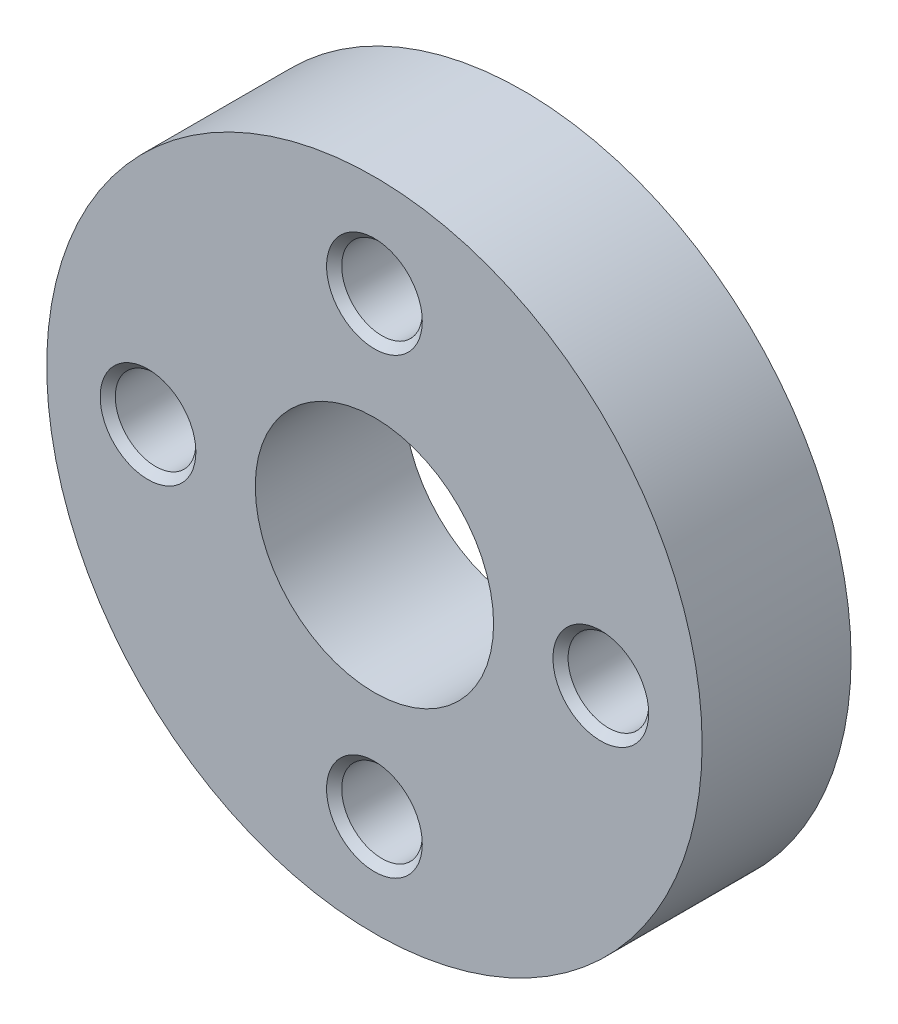
ISO-10303-21;
HEADER;
FILE_DESCRIPTION(('STEP AP214'),'2;1');
FILE_NAME('part.step','',(''),(''),'','','');
FILE_SCHEMA(('AUTOMOTIVE_DESIGN { 1 0 10303 214 1 1 1 1 }'));
ENDSEC;
DATA;
#1=APPLICATION_CONTEXT('core data for automotive mechanical design processes');
#2=APPLICATION_PROTOCOL_DEFINITION('international standard','automotive_design',2000,#1);
#3=PRODUCT_CONTEXT('',#1,'mechanical');
#4=PRODUCT('Part','Part','',(#3));
#5=PRODUCT_RELATED_PRODUCT_CATEGORY('part','',(#4));
#6=PRODUCT_DEFINITION_FORMATION('','',#4);
#7=PRODUCT_DEFINITION_CONTEXT('part definition',#1,'design');
#8=PRODUCT_DEFINITION('design','',#6,#7);
#9=PRODUCT_DEFINITION_SHAPE('','',#8);
#10=(LENGTH_UNIT() NAMED_UNIT(*) SI_UNIT(.MILLI.,.METRE.));
#11=(NAMED_UNIT(*) PLANE_ANGLE_UNIT() SI_UNIT($,.RADIAN.));
#12=(NAMED_UNIT(*) SI_UNIT($,.STERADIAN.) SOLID_ANGLE_UNIT());
#13=UNCERTAINTY_MEASURE_WITH_UNIT(LENGTH_MEASURE(1.E-05),#10,'distance_accuracy_value','');
#14=(GEOMETRIC_REPRESENTATION_CONTEXT(3) GLOBAL_UNCERTAINTY_ASSIGNED_CONTEXT((#13)) GLOBAL_UNIT_ASSIGNED_CONTEXT((#10,
#11,#12)) REPRESENTATION_CONTEXT('',''));
#15=CARTESIAN_POINT('',(0.,0.,0.));
#16=DIRECTION('',(0.,0.,1.));
#17=DIRECTION('',(1.,0.,0.));
#18=AXIS2_PLACEMENT_3D('',#15,#16,#17);
#19=CARTESIAN_POINT('',(0.,0.,-2.5));
#20=DIRECTION('',(0.,0.,1.));
#21=DIRECTION('',(1.,0.,0.));
#22=AXIS2_PLACEMENT_3D('',#19,#20,#21);
#23=CYLINDRICAL_SURFACE('',#22,11.);
#24=CARTESIAN_POINT('',(0.,0.,-2.5));
#25=DIRECTION('',(0.,0.,1.));
#26=DIRECTION('',(1.,0.,0.));
#27=AXIS2_PLACEMENT_3D('',#24,#25,#26);
#28=CIRCLE('',#27,11.);
#29=CARTESIAN_POINT('',(11.,0.,-2.5));
#30=VERTEX_POINT('',#29);
#31=EDGE_CURVE('E90',#30,#30,#28,.T.);
#32=ORIENTED_EDGE('',*,*,#31,.T.);
#33=EDGE_LOOP('',(#32));
#34=FACE_BOUND('',#33,.T.);
#35=CARTESIAN_POINT('',(0.,0.,2.5));
#36=DIRECTION('',(0.,0.,1.));
#37=DIRECTION('',(1.,0.,0.));
#38=AXIS2_PLACEMENT_3D('',#35,#36,#37);
#39=CIRCLE('',#38,11.);
#40=CARTESIAN_POINT('',(11.,0.,2.5));
#41=VERTEX_POINT('',#40);
#42=EDGE_CURVE('E91',#41,#41,#39,.T.);
#43=ORIENTED_EDGE('',*,*,#42,.F.);
#44=EDGE_LOOP('',(#43));
#45=FACE_BOUND('',#44,.T.);
#46=ADVANCED_FACE('F34',(#34,#45),#23,.T.);
#47=CARTESIAN_POINT('',(0.,0.,-2.5));
#48=DIRECTION('',(0.,0.,1.));
#49=DIRECTION('',(1.,0.,0.));
#50=AXIS2_PLACEMENT_3D('',#47,#48,#49);
#51=PLANE('',#50);
#52=CARTESIAN_POINT('',(0.,0.,-2.5));
#53=DIRECTION('',(0.,0.,1.));
#54=DIRECTION('',(1.,0.,0.));
#55=AXIS2_PLACEMENT_3D('',#52,#53,#54);
#56=CIRCLE('',#55,4.);
#57=CARTESIAN_POINT('',(4.,0.,-2.5));
#58=VERTEX_POINT('',#57);
#59=EDGE_CURVE('E94',#58,#58,#56,.T.);
#60=ORIENTED_EDGE('',*,*,#59,.T.);
#61=EDGE_LOOP('',(#60));
#62=FACE_BOUND('',#61,.T.);
#63=CARTESIAN_POINT('',(0.,-7.59934207678533,-2.5));
#64=DIRECTION('',(0.,0.,1.));
#65=DIRECTION('',(1.,0.,0.));
#66=AXIS2_PLACEMENT_3D('',#63,#64,#65);
#67=CIRCLE('',#66,1.60654999999999);
#68=CARTESIAN_POINT('',(1.60654999999999,-7.59934207678533,-2.5));
#69=VERTEX_POINT('',#68);
#70=EDGE_CURVE('E78',#69,#69,#67,.T.);
#71=ORIENTED_EDGE('',*,*,#70,.T.);
#72=EDGE_LOOP('',(#71));
#73=FACE_BOUND('',#72,.T.);
#74=CARTESIAN_POINT('',(-7.59934207678533,0.,-2.5));
#75=DIRECTION('',(0.,0.,1.));
#76=DIRECTION('',(1.,0.,0.));
#77=AXIS2_PLACEMENT_3D('',#74,#75,#76);
#78=CIRCLE('',#77,1.60655);
#79=CARTESIAN_POINT('',(-5.99279207678533,0.,-2.5));
#80=VERTEX_POINT('',#79);
#81=EDGE_CURVE('E81',#80,#80,#78,.T.);
#82=ORIENTED_EDGE('',*,*,#81,.T.);
#83=EDGE_LOOP('',(#82));
#84=FACE_BOUND('',#83,.T.);
#85=CARTESIAN_POINT('',(0.,7.59934207678533,-2.5));
#86=DIRECTION('',(0.,0.,1.));
#87=DIRECTION('',(1.,0.,0.));
#88=AXIS2_PLACEMENT_3D('',#85,#86,#87);
#89=CIRCLE('',#88,1.60654999999999);
#90=CARTESIAN_POINT('',(1.60654999999999,7.59934207678533,-2.5));
#91=VERTEX_POINT('',#90);
#92=EDGE_CURVE('E84',#91,#91,#89,.T.);
#93=ORIENTED_EDGE('',*,*,#92,.T.);
#94=EDGE_LOOP('',(#93));
#95=FACE_BOUND('',#94,.T.);
#96=CARTESIAN_POINT('',(7.59934207678533,0.,-2.5));
#97=DIRECTION('',(0.,0.,1.));
#98=DIRECTION('',(1.,0.,0.));
#99=AXIS2_PLACEMENT_3D('',#96,#97,#98);
#100=CIRCLE('',#99,1.60654999999999);
#101=CARTESIAN_POINT('',(9.20589207678533,0.,-2.5));
#102=VERTEX_POINT('',#101);
#103=EDGE_CURVE('E87',#102,#102,#100,.T.);
#104=ORIENTED_EDGE('',*,*,#103,.T.);
#105=EDGE_LOOP('',(#104));
#106=FACE_BOUND('',#105,.T.);
#107=ORIENTED_EDGE('',*,*,#31,.F.);
#108=EDGE_LOOP('',(#107));
#109=FACE_BOUND('',#108,.T.);
#110=ADVANCED_FACE('F103',(#62,#73,#84,#95,#106,#109),#51,.F.);
#111=CARTESIAN_POINT('',(0.,0.,2.5));
#112=DIRECTION('',(0.,0.,1.));
#113=DIRECTION('',(1.,0.,0.));
#114=AXIS2_PLACEMENT_3D('',#111,#112,#113);
#115=PLANE('',#114);
#116=CARTESIAN_POINT('',(0.,0.,2.5));
#117=DIRECTION('',(0.,0.,1.));
#118=DIRECTION('',(1.,0.,0.));
#119=AXIS2_PLACEMENT_3D('',#116,#117,#118);
#120=CIRCLE('',#119,4.);
#121=CARTESIAN_POINT('',(4.,0.,2.5));
#122=VERTEX_POINT('',#121);
#123=EDGE_CURVE('E97',#122,#122,#120,.T.);
#124=ORIENTED_EDGE('',*,*,#123,.F.);
#125=EDGE_LOOP('',(#124));
#126=FACE_BOUND('',#125,.T.);
#127=CARTESIAN_POINT('',(7.59934207678533,0.,2.5));
#128=DIRECTION('',(0.,0.,1.));
#129=DIRECTION('',(1.,0.,0.));
#130=AXIS2_PLACEMENT_3D('',#127,#128,#129);
#131=CIRCLE('',#130,1.60654999999999);
#132=CARTESIAN_POINT('',(9.20589207678532,0.,2.5));
#133=VERTEX_POINT('',#132);
#134=EDGE_CURVE('E10',#133,#133,#131,.F.);
#135=ORIENTED_EDGE('',*,*,#134,.T.);
#136=EDGE_LOOP('',(#135));
#137=FACE_BOUND('',#136,.T.);
#138=CARTESIAN_POINT('',(0.,-7.59934207678533,2.5));
#139=DIRECTION('',(0.,0.,1.));
#140=DIRECTION('',(1.,0.,0.));
#141=AXIS2_PLACEMENT_3D('',#138,#139,#140);
#142=CIRCLE('',#141,1.60654999999999);
#143=CARTESIAN_POINT('',(1.60654999999999,-7.59934207678533,2.5));
#144=VERTEX_POINT('',#143);
#145=EDGE_CURVE('E41',#144,#144,#142,.F.);
#146=ORIENTED_EDGE('',*,*,#145,.T.);
#147=EDGE_LOOP('',(#146));
#148=FACE_BOUND('',#147,.T.);
#149=CARTESIAN_POINT('',(-7.59934207678533,0.,2.5));
#150=DIRECTION('',(0.,0.,1.));
#151=DIRECTION('',(1.,0.,0.));
#152=AXIS2_PLACEMENT_3D('',#149,#150,#151);
#153=CIRCLE('',#152,1.60654999999999);
#154=CARTESIAN_POINT('',(-5.99279207678534,0.,2.5));
#155=VERTEX_POINT('',#154);
#156=EDGE_CURVE('E45',#155,#155,#153,.F.);
#157=ORIENTED_EDGE('',*,*,#156,.T.);
#158=EDGE_LOOP('',(#157));
#159=FACE_BOUND('',#158,.T.);
#160=CARTESIAN_POINT('',(0.,7.59934207678533,2.5));
#161=DIRECTION('',(0.,0.,1.));
#162=DIRECTION('',(1.,0.,0.));
#163=AXIS2_PLACEMENT_3D('',#160,#161,#162);
#164=CIRCLE('',#163,1.60654999999999);
#165=CARTESIAN_POINT('',(1.60654999999999,7.59934207678533,2.5));
#166=VERTEX_POINT('',#165);
#167=EDGE_CURVE('E49',#166,#166,#164,.F.);
#168=ORIENTED_EDGE('',*,*,#167,.T.);
#169=EDGE_LOOP('',(#168));
#170=FACE_BOUND('',#169,.T.);
#171=ORIENTED_EDGE('',*,*,#42,.T.);
#172=EDGE_LOOP('',(#171));
#173=FACE_BOUND('',#172,.T.);
#174=ADVANCED_FACE('F112',(#126,#137,#148,#159,#170,#173),#115,.T.);
#175=CARTESIAN_POINT('',(0.,-7.59934207678533,2.5));
#176=DIRECTION('',(0.,0.,1.));
#177=DIRECTION('',(1.,0.,0.));
#178=AXIS2_PLACEMENT_3D('',#175,#176,#177);
#179=CYLINDRICAL_SURFACE('',#178,1.35254999999999);
#180=CARTESIAN_POINT('',(0.,-7.59934207678533,-2.246));
#181=DIRECTION('',(0.,0.,1.));
#182=DIRECTION('',(1.,0.,0.));
#183=AXIS2_PLACEMENT_3D('',#180,#181,#182);
#184=CIRCLE('',#183,1.35254999999999);
#185=CARTESIAN_POINT('',(1.35254999999999,-7.59934207678533,-2.246));
#186=VERTEX_POINT('',#185);
#187=EDGE_CURVE('E72',#186,#186,#184,.F.);
#188=ORIENTED_EDGE('',*,*,#187,.T.);
#189=EDGE_LOOP('',(#188));
#190=FACE_BOUND('',#189,.T.);
#191=CARTESIAN_POINT('',(0.,-7.59934207678533,2.246));
#192=DIRECTION('',(0.,0.,1.));
#193=DIRECTION('',(1.,0.,0.));
#194=AXIS2_PLACEMENT_3D('',#191,#192,#193);
#195=CIRCLE('',#194,1.35254999999999);
#196=CARTESIAN_POINT('',(1.35254999999999,-7.59934207678533,2.246));
#197=VERTEX_POINT('',#196);
#198=EDGE_CURVE('E75',#197,#197,#195,.T.);
#199=ORIENTED_EDGE('',*,*,#198,.T.);
#200=EDGE_LOOP('',(#199));
#201=FACE_BOUND('',#200,.T.);
#202=ADVANCED_FACE('F114',(#190,#201),#179,.F.);
#203=CARTESIAN_POINT('',(7.59934207678533,0.,2.5));
#204=DIRECTION('',(0.,0.,1.));
#205=DIRECTION('',(1.,0.,0.));
#206=AXIS2_PLACEMENT_3D('',#203,#204,#205);
#207=CYLINDRICAL_SURFACE('',#206,1.35254999999999);
#208=CARTESIAN_POINT('',(7.59934207678533,0.,-2.246));
#209=DIRECTION('',(0.,0.,1.));
#210=DIRECTION('',(1.,0.,0.));
#211=AXIS2_PLACEMENT_3D('',#208,#209,#210);
#212=CIRCLE('',#211,1.35254999999999);
#213=CARTESIAN_POINT('',(8.95189207678532,0.,-2.246));
#214=VERTEX_POINT('',#213);
#215=EDGE_CURVE('E54',#214,#214,#212,.F.);
#216=ORIENTED_EDGE('',*,*,#215,.T.);
#217=EDGE_LOOP('',(#216));
#218=FACE_BOUND('',#217,.T.);
#219=CARTESIAN_POINT('',(7.59934207678533,0.,2.246));
#220=DIRECTION('',(0.,0.,1.));
#221=DIRECTION('',(1.,0.,0.));
#222=AXIS2_PLACEMENT_3D('',#219,#220,#221);
#223=CIRCLE('',#222,1.35254999999999);
#224=CARTESIAN_POINT('',(8.95189207678532,0.,2.246));
#225=VERTEX_POINT('',#224);
#226=EDGE_CURVE('E57',#225,#225,#223,.T.);
#227=ORIENTED_EDGE('',*,*,#226,.T.);
#228=EDGE_LOOP('',(#227));
#229=FACE_BOUND('',#228,.T.);
#230=ADVANCED_FACE('F167',(#218,#229),#207,.F.);
#231=CARTESIAN_POINT('',(-7.59934207678533,0.,2.5));
#232=DIRECTION('',(0.,0.,1.));
#233=DIRECTION('',(1.,0.,0.));
#234=AXIS2_PLACEMENT_3D('',#231,#232,#233);
#235=CYLINDRICAL_SURFACE('',#234,1.35254999999999);
#236=CARTESIAN_POINT('',(-7.59934207678533,0.,-2.24599999999999));
#237=DIRECTION('',(0.,0.,1.));
#238=DIRECTION('',(1.,0.,0.));
#239=AXIS2_PLACEMENT_3D('',#236,#237,#238);
#240=CIRCLE('',#239,1.35254999999999);
#241=CARTESIAN_POINT('',(-6.24679207678534,0.,-2.24599999999999));
#242=VERTEX_POINT('',#241);
#243=EDGE_CURVE('E66',#242,#242,#240,.F.);
#244=ORIENTED_EDGE('',*,*,#243,.T.);
#245=EDGE_LOOP('',(#244));
#246=FACE_BOUND('',#245,.T.);
#247=CARTESIAN_POINT('',(-7.59934207678533,0.,2.246));
#248=DIRECTION('',(0.,0.,1.));
#249=DIRECTION('',(1.,0.,0.));
#250=AXIS2_PLACEMENT_3D('',#247,#248,#249);
#251=CIRCLE('',#250,1.35254999999999);
#252=CARTESIAN_POINT('',(-6.24679207678534,0.,2.246));
#253=VERTEX_POINT('',#252);
#254=EDGE_CURVE('E69',#253,#253,#251,.T.);
#255=ORIENTED_EDGE('',*,*,#254,.T.);
#256=EDGE_LOOP('',(#255));
#257=FACE_BOUND('',#256,.T.);
#258=ADVANCED_FACE('F165',(#246,#257),#235,.F.);
#259=CARTESIAN_POINT('',(0.,7.59934207678533,2.5));
#260=DIRECTION('',(0.,0.,1.));
#261=DIRECTION('',(1.,0.,0.));
#262=AXIS2_PLACEMENT_3D('',#259,#260,#261);
#263=CYLINDRICAL_SURFACE('',#262,1.35254999999999);
#264=CARTESIAN_POINT('',(0.,7.59934207678533,-2.246));
#265=DIRECTION('',(0.,0.,1.));
#266=DIRECTION('',(1.,0.,0.));
#267=AXIS2_PLACEMENT_3D('',#264,#265,#266);
#268=CIRCLE('',#267,1.35254999999999);
#269=CARTESIAN_POINT('',(1.35254999999999,7.59934207678533,-2.246));
#270=VERTEX_POINT('',#269);
#271=EDGE_CURVE('E60',#270,#270,#268,.F.);
#272=ORIENTED_EDGE('',*,*,#271,.T.);
#273=EDGE_LOOP('',(#272));
#274=FACE_BOUND('',#273,.T.);
#275=CARTESIAN_POINT('',(0.,7.59934207678533,2.246));
#276=DIRECTION('',(0.,0.,1.));
#277=DIRECTION('',(1.,0.,0.));
#278=AXIS2_PLACEMENT_3D('',#275,#276,#277);
#279=CIRCLE('',#278,1.35254999999999);
#280=CARTESIAN_POINT('',(1.35254999999999,7.59934207678533,2.246));
#281=VERTEX_POINT('',#280);
#282=EDGE_CURVE('E63',#281,#281,#279,.T.);
#283=ORIENTED_EDGE('',*,*,#282,.T.);
#284=EDGE_LOOP('',(#283));
#285=FACE_BOUND('',#284,.T.);
#286=ADVANCED_FACE('F135',(#274,#285),#263,.F.);
#287=CARTESIAN_POINT('',(0.,-7.59934207678533,-2.5));
#288=DIRECTION('',(0.,0.,-1.));
#289=DIRECTION('',(-1.,0.,0.));
#290=AXIS2_PLACEMENT_3D('',#287,#288,#289);
#291=CONICAL_SURFACE('',#290,1.60654999999999,0.785398163397451);
#292=ORIENTED_EDGE('',*,*,#187,.F.);
#293=EDGE_LOOP('',(#292));
#294=FACE_BOUND('',#293,.T.);
#295=ORIENTED_EDGE('',*,*,#70,.F.);
#296=EDGE_LOOP('',(#295));
#297=FACE_BOUND('',#296,.T.);
#298=ADVANCED_FACE('F131',(#294,#297),#291,.F.);
#299=CARTESIAN_POINT('',(-7.59934207678533,0.,-2.5));
#300=DIRECTION('',(0.,0.,-1.));
#301=DIRECTION('',(-1.,0.,0.));
#302=AXIS2_PLACEMENT_3D('',#299,#300,#301);
#303=CONICAL_SURFACE('',#302,1.60655,0.785398163397441);
#304=ORIENTED_EDGE('',*,*,#243,.F.);
#305=EDGE_LOOP('',(#304));
#306=FACE_BOUND('',#305,.T.);
#307=ORIENTED_EDGE('',*,*,#81,.F.);
#308=EDGE_LOOP('',(#307));
#309=FACE_BOUND('',#308,.T.);
#310=ADVANCED_FACE('F134',(#306,#309),#303,.F.);
#311=CARTESIAN_POINT('',(0.,7.59934207678533,-2.5));
#312=DIRECTION('',(0.,0.,-1.));
#313=DIRECTION('',(-1.,0.,0.));
#314=AXIS2_PLACEMENT_3D('',#311,#312,#313);
#315=CONICAL_SURFACE('',#314,1.60654999999999,0.785398163397451);
#316=ORIENTED_EDGE('',*,*,#271,.F.);
#317=EDGE_LOOP('',(#316));
#318=FACE_BOUND('',#317,.T.);
#319=ORIENTED_EDGE('',*,*,#92,.F.);
#320=EDGE_LOOP('',(#319));
#321=FACE_BOUND('',#320,.T.);
#322=ADVANCED_FACE('F139',(#318,#321),#315,.F.);
#323=CARTESIAN_POINT('',(7.59934207678533,0.,-2.5));
#324=DIRECTION('',(0.,0.,-1.));
#325=DIRECTION('',(-1.,0.,0.));
#326=AXIS2_PLACEMENT_3D('',#323,#324,#325);
#327=CONICAL_SURFACE('',#326,1.60654999999999,0.78539816339745);
#328=ORIENTED_EDGE('',*,*,#215,.F.);
#329=EDGE_LOOP('',(#328));
#330=FACE_BOUND('',#329,.T.);
#331=ORIENTED_EDGE('',*,*,#103,.F.);
#332=EDGE_LOOP('',(#331));
#333=FACE_BOUND('',#332,.T.);
#334=ADVANCED_FACE('F143',(#330,#333),#327,.F.);
#335=CARTESIAN_POINT('',(7.59934207678533,0.,2.246));
#336=DIRECTION('',(0.,0.,1.));
#337=DIRECTION('',(1.,0.,0.));
#338=AXIS2_PLACEMENT_3D('',#335,#336,#337);
#339=CONICAL_SURFACE('',#338,1.35254999999999,0.785398163397453);
#340=ORIENTED_EDGE('',*,*,#134,.F.);
#341=EDGE_LOOP('',(#340));
#342=FACE_BOUND('',#341,.T.);
#343=ORIENTED_EDGE('',*,*,#226,.F.);
#344=EDGE_LOOP('',(#343));
#345=FACE_BOUND('',#344,.T.);
#346=ADVANCED_FACE('F147',(#342,#345),#339,.F.);
#347=CARTESIAN_POINT('',(0.,-7.59934207678533,2.246));
#348=DIRECTION('',(0.,0.,1.));
#349=DIRECTION('',(1.,0.,0.));
#350=AXIS2_PLACEMENT_3D('',#347,#348,#349);
#351=CONICAL_SURFACE('',#350,1.35254999999999,0.785398163397452);
#352=ORIENTED_EDGE('',*,*,#145,.F.);
#353=EDGE_LOOP('',(#352));
#354=FACE_BOUND('',#353,.T.);
#355=ORIENTED_EDGE('',*,*,#198,.F.);
#356=EDGE_LOOP('',(#355));
#357=FACE_BOUND('',#356,.T.);
#358=ADVANCED_FACE('F151',(#354,#357),#351,.F.);
#359=CARTESIAN_POINT('',(-7.59934207678533,0.,2.246));
#360=DIRECTION('',(0.,0.,1.));
#361=DIRECTION('',(1.,0.,0.));
#362=AXIS2_PLACEMENT_3D('',#359,#360,#361);
#363=CONICAL_SURFACE('',#362,1.35254999999999,0.785398163397452);
#364=ORIENTED_EDGE('',*,*,#156,.F.);
#365=EDGE_LOOP('',(#364));
#366=FACE_BOUND('',#365,.T.);
#367=ORIENTED_EDGE('',*,*,#254,.F.);
#368=EDGE_LOOP('',(#367));
#369=FACE_BOUND('',#368,.T.);
#370=ADVANCED_FACE('F154',(#366,#369),#363,.F.);
#371=CARTESIAN_POINT('',(0.,7.59934207678533,2.246));
#372=DIRECTION('',(0.,0.,1.));
#373=DIRECTION('',(1.,0.,0.));
#374=AXIS2_PLACEMENT_3D('',#371,#372,#373);
#375=CONICAL_SURFACE('',#374,1.35254999999999,0.785398163397452);
#376=ORIENTED_EDGE('',*,*,#167,.F.);
#377=EDGE_LOOP('',(#376));
#378=FACE_BOUND('',#377,.T.);
#379=ORIENTED_EDGE('',*,*,#282,.F.);
#380=EDGE_LOOP('',(#379));
#381=FACE_BOUND('',#380,.T.);
#382=ADVANCED_FACE('F36',(#378,#381),#375,.F.);
#383=CARTESIAN_POINT('',(0.,0.,-2.5));
#384=DIRECTION('',(0.,0.,1.));
#385=DIRECTION('',(1.,0.,0.));
#386=AXIS2_PLACEMENT_3D('',#383,#384,#385);
#387=CYLINDRICAL_SURFACE('',#386,4.);
#388=ORIENTED_EDGE('',*,*,#59,.F.);
#389=EDGE_LOOP('',(#388));
#390=FACE_BOUND('',#389,.T.);
#391=ORIENTED_EDGE('',*,*,#123,.T.);
#392=EDGE_LOOP('',(#391));
#393=FACE_BOUND('',#392,.T.);
#394=ADVANCED_FACE('F106',(#390,#393),#387,.F.);
#395=CLOSED_SHELL('',(#46,#110,#174,#202,#230,#258,#286,#298,#310,#322,#334,#346,#358,#370,#382,#394));
#396=MANIFOLD_SOLID_BREP('B2',#395);
#397=ADVANCED_BREP_SHAPE_REPRESENTATION('',(#18,#396),#14);
#398=SHAPE_DEFINITION_REPRESENTATION(#9,#397);
ENDSEC;
END-ISO-10303-21;
